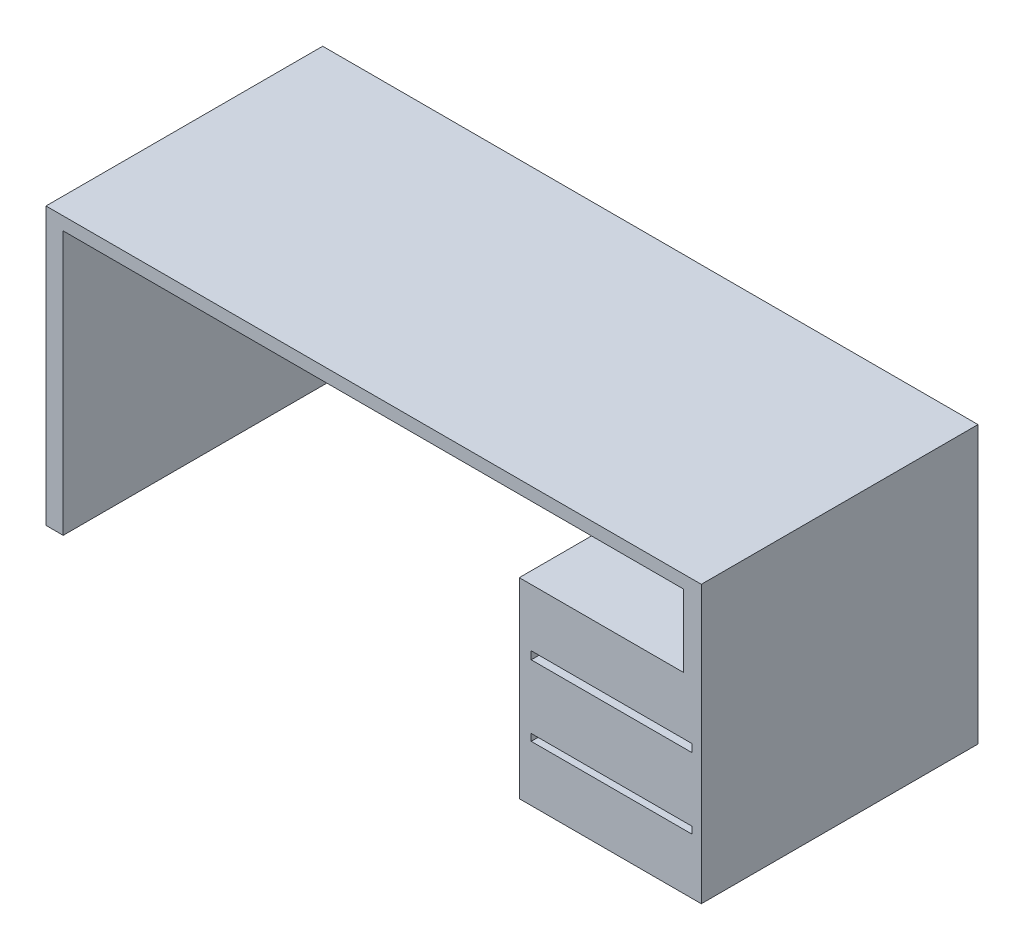
ISO-10303-21;
HEADER;
FILE_DESCRIPTION(('STEP AP214'),'2;1');
FILE_NAME('part.step','',(''),(''),'','','');
FILE_SCHEMA(('AUTOMOTIVE_DESIGN { 1 0 10303 214 1 1 1 1 }'));
ENDSEC;
DATA;
#1=APPLICATION_CONTEXT('core data for automotive mechanical design processes');
#2=APPLICATION_PROTOCOL_DEFINITION('international standard','automotive_design',2000,#1);
#3=PRODUCT_CONTEXT('',#1,'mechanical');
#4=PRODUCT('Part','Part','',(#3));
#5=PRODUCT_RELATED_PRODUCT_CATEGORY('part','',(#4));
#6=PRODUCT_DEFINITION_FORMATION('','',#4);
#7=PRODUCT_DEFINITION_CONTEXT('part definition',#1,'design');
#8=PRODUCT_DEFINITION('design','',#6,#7);
#9=PRODUCT_DEFINITION_SHAPE('','',#8);
#10=(LENGTH_UNIT() NAMED_UNIT(*) SI_UNIT(.MILLI.,.METRE.));
#11=(NAMED_UNIT(*) PLANE_ANGLE_UNIT() SI_UNIT($,.RADIAN.));
#12=(NAMED_UNIT(*) SI_UNIT($,.STERADIAN.) SOLID_ANGLE_UNIT());
#13=UNCERTAINTY_MEASURE_WITH_UNIT(LENGTH_MEASURE(1.E-05),#10,'distance_accuracy_value','');
#14=(GEOMETRIC_REPRESENTATION_CONTEXT(3) GLOBAL_UNCERTAINTY_ASSIGNED_CONTEXT((#13)) GLOBAL_UNIT_ASSIGNED_CONTEXT((#10,
#11,#12)) REPRESENTATION_CONTEXT('',''));
#15=CARTESIAN_POINT('',(0.,0.,0.));
#16=DIRECTION('',(0.,0.,1.));
#17=DIRECTION('',(1.,0.,0.));
#18=AXIS2_PLACEMENT_3D('',#15,#16,#17);
#19=CARTESIAN_POINT('',(47.2136844991558,0.,760.));
#20=DIRECTION('',(0.,1.,0.));
#21=DIRECTION('',(0.,0.,1.));
#22=AXIS2_PLACEMENT_3D('',#19,#20,#21);
#23=PLANE('',#22);
#24=DIRECTION('',(1.,0.,0.));
#25=VECTOR('',#24,1.);
#26=CARTESIAN_POINT('',(47.2136844991558,0.,0.));
#27=LINE('',#26,#25);
#28=CARTESIAN_POINT('',(0.,0.,0.));
#29=VERTEX_POINT('',#28);
#30=CARTESIAN_POINT('',(47.2136844991558,0.,0.));
#31=VERTEX_POINT('',#30);
#32=EDGE_CURVE('E198',#29,#31,#27,.T.);
#33=ORIENTED_EDGE('',*,*,#32,.T.);
#34=DIRECTION('',(0.,0.,-1.));
#35=VECTOR('',#34,1.);
#36=CARTESIAN_POINT('',(47.2136844991558,0.,760.));
#37=LINE('',#36,#35);
#38=CARTESIAN_POINT('',(47.2136844991558,0.,760.));
#39=VERTEX_POINT('',#38);
#40=EDGE_CURVE('E273',#39,#31,#37,.T.);
#41=ORIENTED_EDGE('',*,*,#40,.F.);
#42=DIRECTION('',(1.,0.,0.));
#43=VECTOR('',#42,1.);
#44=CARTESIAN_POINT('',(47.2136844991558,0.,760.));
#45=LINE('',#44,#43);
#46=CARTESIAN_POINT('',(0.,0.,760.));
#47=VERTEX_POINT('',#46);
#48=EDGE_CURVE('E205',#47,#39,#45,.T.);
#49=ORIENTED_EDGE('',*,*,#48,.F.);
#50=DIRECTION('',(0.,0.,-1.));
#51=VECTOR('',#50,1.);
#52=CARTESIAN_POINT('',(0.,0.,760.));
#53=LINE('',#52,#51);
#54=EDGE_CURVE('E227',#47,#29,#53,.T.);
#55=ORIENTED_EDGE('',*,*,#54,.T.);
#56=EDGE_LOOP('',(#33,#41,#49,#55));
#57=FACE_BOUND('',#56,.T.);
#58=ADVANCED_FACE('F33',(#57),#23,.F.);
#59=CARTESIAN_POINT('',(47.2136844991558,724.319370664102,760.));
#60=DIRECTION('',(-1.,0.,0.));
#61=DIRECTION('',(0.,0.,1.));
#62=AXIS2_PLACEMENT_3D('',#59,#60,#61);
#63=PLANE('',#62);
#64=DIRECTION('',(0.,1.,0.));
#65=VECTOR('',#64,1.);
#66=CARTESIAN_POINT('',(47.2136844991558,724.319370664102,0.));
#67=LINE('',#66,#65);
#68=CARTESIAN_POINT('',(47.2136844991558,724.319370664102,0.));
#69=VERTEX_POINT('',#68);
#70=EDGE_CURVE('E230',#31,#69,#67,.T.);
#71=ORIENTED_EDGE('',*,*,#70,.T.);
#72=DIRECTION('',(0.,0.,-1.));
#73=VECTOR('',#72,1.);
#74=CARTESIAN_POINT('',(47.2136844991558,724.319370664102,760.));
#75=LINE('',#74,#73);
#76=CARTESIAN_POINT('',(47.2136844991558,724.319370664102,760.));
#77=VERTEX_POINT('',#76);
#78=EDGE_CURVE('E270',#77,#69,#75,.T.);
#79=ORIENTED_EDGE('',*,*,#78,.F.);
#80=DIRECTION('',(0.,1.,0.));
#81=VECTOR('',#80,1.);
#82=CARTESIAN_POINT('',(47.2136844991558,724.319370664102,760.));
#83=LINE('',#82,#81);
#84=EDGE_CURVE('E208',#39,#77,#83,.T.);
#85=ORIENTED_EDGE('',*,*,#84,.F.);
#86=ORIENTED_EDGE('',*,*,#40,.T.);
#87=EDGE_LOOP('',(#71,#79,#85,#86));
#88=FACE_BOUND('',#87,.T.);
#89=ADVANCED_FACE('F310',(#88),#63,.F.);
#90=CARTESIAN_POINT('',(1750.46794536571,724.319370664102,760.));
#91=DIRECTION('',(0.,1.,0.));
#92=DIRECTION('',(-1.,0.,0.));
#93=AXIS2_PLACEMENT_3D('',#90,#91,#92);
#94=PLANE('',#93);
#95=DIRECTION('',(1.,0.,0.));
#96=VECTOR('',#95,1.);
#97=CARTESIAN_POINT('',(1750.46794536571,724.319370664102,0.));
#98=LINE('',#97,#96);
#99=CARTESIAN_POINT('',(1750.46794536571,724.319370664102,0.));
#100=VERTEX_POINT('',#99);
#101=EDGE_CURVE('E232',#69,#100,#98,.T.);
#102=ORIENTED_EDGE('',*,*,#101,.T.);
#103=DIRECTION('',(0.,0.,-1.));
#104=VECTOR('',#103,1.);
#105=CARTESIAN_POINT('',(1750.46794536571,724.319370664102,760.));
#106=LINE('',#105,#104);
#107=CARTESIAN_POINT('',(1750.46794536571,724.319370664102,760.));
#108=VERTEX_POINT('',#107);
#109=EDGE_CURVE('E267',#108,#100,#106,.T.);
#110=ORIENTED_EDGE('',*,*,#109,.F.);
#111=DIRECTION('',(1.,0.,0.));
#112=VECTOR('',#111,1.);
#113=CARTESIAN_POINT('',(1750.46794536571,724.319370664102,760.));
#114=LINE('',#113,#112);
#115=EDGE_CURVE('E211',#77,#108,#114,.T.);
#116=ORIENTED_EDGE('',*,*,#115,.F.);
#117=ORIENTED_EDGE('',*,*,#78,.T.);
#118=EDGE_LOOP('',(#102,#110,#116,#117));
#119=FACE_BOUND('',#118,.T.);
#120=ADVANCED_FACE('F315',(#119),#94,.F.);
#121=CARTESIAN_POINT('',(1750.46794536571,525.84586998317,760.));
#122=DIRECTION('',(1.,0.,0.));
#123=DIRECTION('',(0.,0.,-1.));
#124=AXIS2_PLACEMENT_3D('',#121,#122,#123);
#125=PLANE('',#124);
#126=DIRECTION('',(0.,-1.,0.));
#127=VECTOR('',#126,1.);
#128=CARTESIAN_POINT('',(1750.46794536571,525.84586998317,0.));
#129=LINE('',#128,#127);
#130=CARTESIAN_POINT('',(1750.46794536571,525.84586998317,0.));
#131=VERTEX_POINT('',#130);
#132=EDGE_CURVE('E234',#100,#131,#129,.T.);
#133=ORIENTED_EDGE('',*,*,#132,.T.);
#134=DIRECTION('',(0.,0.,-1.));
#135=VECTOR('',#134,1.);
#136=CARTESIAN_POINT('',(1750.46794536571,525.84586998317,760.));
#137=LINE('',#136,#135);
#138=CARTESIAN_POINT('',(1750.46794536571,525.84586998317,760.));
#139=VERTEX_POINT('',#138);
#140=EDGE_CURVE('E264',#139,#131,#137,.T.);
#141=ORIENTED_EDGE('',*,*,#140,.F.);
#142=DIRECTION('',(0.,-1.,0.));
#143=VECTOR('',#142,1.);
#144=CARTESIAN_POINT('',(1750.46794536571,525.84586998317,760.));
#145=LINE('',#144,#143);
#146=EDGE_CURVE('E213',#108,#139,#145,.T.);
#147=ORIENTED_EDGE('',*,*,#146,.F.);
#148=ORIENTED_EDGE('',*,*,#109,.T.);
#149=EDGE_LOOP('',(#133,#141,#147,#148));
#150=FACE_BOUND('',#149,.T.);
#151=ADVANCED_FACE('F359',(#150),#125,.F.);
#152=CARTESIAN_POINT('',(1300.,525.84586998317,760.));
#153=DIRECTION('',(0.,-1.,0.));
#154=DIRECTION('',(0.,0.,-1.));
#155=AXIS2_PLACEMENT_3D('',#152,#153,#154);
#156=PLANE('',#155);
#157=DIRECTION('',(-1.,0.,0.));
#158=VECTOR('',#157,1.);
#159=CARTESIAN_POINT('',(1300.,525.84586998317,0.));
#160=LINE('',#159,#158);
#161=CARTESIAN_POINT('',(1300.,525.84586998317,0.));
#162=VERTEX_POINT('',#161);
#163=EDGE_CURVE('E236',#131,#162,#160,.T.);
#164=ORIENTED_EDGE('',*,*,#163,.T.);
#165=DIRECTION('',(0.,0.,-1.));
#166=VECTOR('',#165,1.);
#167=CARTESIAN_POINT('',(1300.,525.84586998317,760.));
#168=LINE('',#167,#166);
#169=CARTESIAN_POINT('',(1300.,525.84586998317,760.));
#170=VERTEX_POINT('',#169);
#171=EDGE_CURVE('E261',#170,#162,#168,.T.);
#172=ORIENTED_EDGE('',*,*,#171,.F.);
#173=DIRECTION('',(-1.,0.,0.));
#174=VECTOR('',#173,1.);
#175=CARTESIAN_POINT('',(1300.,525.84586998317,760.));
#176=LINE('',#175,#174);
#177=EDGE_CURVE('E215',#139,#170,#176,.T.);
#178=ORIENTED_EDGE('',*,*,#177,.F.);
#179=ORIENTED_EDGE('',*,*,#140,.T.);
#180=EDGE_LOOP('',(#164,#172,#178,#179));
#181=FACE_BOUND('',#180,.T.);
#182=ADVANCED_FACE('F354',(#181),#156,.F.);
#183=CARTESIAN_POINT('',(1300.,0.,760.));
#184=DIRECTION('',(1.,0.,0.));
#185=DIRECTION('',(0.,0.,-1.));
#186=AXIS2_PLACEMENT_3D('',#183,#184,#185);
#187=PLANE('',#186);
#188=DIRECTION('',(0.,-1.,0.));
#189=VECTOR('',#188,1.);
#190=CARTESIAN_POINT('',(1300.,0.,0.));
#191=LINE('',#190,#189);
#192=CARTESIAN_POINT('',(1300.,0.,0.));
#193=VERTEX_POINT('',#192);
#194=EDGE_CURVE('E238',#162,#193,#191,.T.);
#195=ORIENTED_EDGE('',*,*,#194,.T.);
#196=DIRECTION('',(0.,0.,-1.));
#197=VECTOR('',#196,1.);
#198=CARTESIAN_POINT('',(1300.,0.,760.));
#199=LINE('',#198,#197);
#200=CARTESIAN_POINT('',(1300.,0.,760.));
#201=VERTEX_POINT('',#200);
#202=EDGE_CURVE('E258',#201,#193,#199,.T.);
#203=ORIENTED_EDGE('',*,*,#202,.F.);
#204=DIRECTION('',(0.,-1.,0.));
#205=VECTOR('',#204,1.);
#206=CARTESIAN_POINT('',(1300.,0.,760.));
#207=LINE('',#206,#205);
#208=EDGE_CURVE('E217',#170,#201,#207,.T.);
#209=ORIENTED_EDGE('',*,*,#208,.F.);
#210=ORIENTED_EDGE('',*,*,#171,.T.);
#211=EDGE_LOOP('',(#195,#203,#209,#210));
#212=FACE_BOUND('',#211,.T.);
#213=ADVANCED_FACE('F350',(#212),#187,.F.);
#214=CARTESIAN_POINT('',(1800.,0.,760.));
#215=DIRECTION('',(0.,1.,0.));
#216=DIRECTION('',(-1.,0.,0.));
#217=AXIS2_PLACEMENT_3D('',#214,#215,#216);
#218=PLANE('',#217);
#219=DIRECTION('',(1.,0.,0.));
#220=VECTOR('',#219,1.);
#221=CARTESIAN_POINT('',(1800.,0.,0.));
#222=LINE('',#221,#220);
#223=CARTESIAN_POINT('',(1800.,0.,0.));
#224=VERTEX_POINT('',#223);
#225=EDGE_CURVE('E240',#193,#224,#222,.T.);
#226=ORIENTED_EDGE('',*,*,#225,.T.);
#227=DIRECTION('',(0.,0.,-1.));
#228=VECTOR('',#227,1.);
#229=CARTESIAN_POINT('',(1800.,0.,760.));
#230=LINE('',#229,#228);
#231=CARTESIAN_POINT('',(1800.,0.,760.));
#232=VERTEX_POINT('',#231);
#233=EDGE_CURVE('E255',#232,#224,#230,.T.);
#234=ORIENTED_EDGE('',*,*,#233,.F.);
#235=DIRECTION('',(1.,0.,0.));
#236=VECTOR('',#235,1.);
#237=CARTESIAN_POINT('',(1800.,0.,760.));
#238=LINE('',#237,#236);
#239=EDGE_CURVE('E219',#201,#232,#238,.T.);
#240=ORIENTED_EDGE('',*,*,#239,.F.);
#241=ORIENTED_EDGE('',*,*,#202,.T.);
#242=EDGE_LOOP('',(#226,#234,#240,#241));
#243=FACE_BOUND('',#242,.T.);
#244=ADVANCED_FACE('F346',(#243),#218,.F.);
#245=CARTESIAN_POINT('',(1800.,760.,760.));
#246=DIRECTION('',(-1.,0.,0.));
#247=DIRECTION('',(0.,-1.,0.));
#248=AXIS2_PLACEMENT_3D('',#245,#246,#247);
#249=PLANE('',#248);
#250=DIRECTION('',(0.,1.,0.));
#251=VECTOR('',#250,1.);
#252=CARTESIAN_POINT('',(1800.,760.,0.));
#253=LINE('',#252,#251);
#254=CARTESIAN_POINT('',(1800.,760.,0.));
#255=VERTEX_POINT('',#254);
#256=EDGE_CURVE('E242',#224,#255,#253,.T.);
#257=ORIENTED_EDGE('',*,*,#256,.T.);
#258=DIRECTION('',(0.,0.,-1.));
#259=VECTOR('',#258,1.);
#260=CARTESIAN_POINT('',(1800.,760.,760.));
#261=LINE('',#260,#259);
#262=CARTESIAN_POINT('',(1800.,760.,760.));
#263=VERTEX_POINT('',#262);
#264=EDGE_CURVE('E252',#263,#255,#261,.T.);
#265=ORIENTED_EDGE('',*,*,#264,.F.);
#266=DIRECTION('',(0.,1.,0.));
#267=VECTOR('',#266,1.);
#268=CARTESIAN_POINT('',(1800.,760.,760.));
#269=LINE('',#268,#267);
#270=EDGE_CURVE('E221',#232,#263,#269,.T.);
#271=ORIENTED_EDGE('',*,*,#270,.F.);
#272=ORIENTED_EDGE('',*,*,#233,.T.);
#273=EDGE_LOOP('',(#257,#265,#271,#272));
#274=FACE_BOUND('',#273,.T.);
#275=ADVANCED_FACE('F341',(#274),#249,.F.);
#276=CARTESIAN_POINT('',(0.,760.,760.));
#277=DIRECTION('',(0.,-1.,0.));
#278=DIRECTION('',(0.,0.,-1.));
#279=AXIS2_PLACEMENT_3D('',#276,#277,#278);
#280=PLANE('',#279);
#281=DIRECTION('',(-1.,0.,0.));
#282=VECTOR('',#281,1.);
#283=CARTESIAN_POINT('',(0.,760.,0.));
#284=LINE('',#283,#282);
#285=CARTESIAN_POINT('',(0.,760.,0.));
#286=VERTEX_POINT('',#285);
#287=EDGE_CURVE('E244',#255,#286,#284,.T.);
#288=ORIENTED_EDGE('',*,*,#287,.T.);
#289=DIRECTION('',(0.,0.,-1.));
#290=VECTOR('',#289,1.);
#291=CARTESIAN_POINT('',(0.,760.,760.));
#292=LINE('',#291,#290);
#293=CARTESIAN_POINT('',(0.,760.,760.));
#294=VERTEX_POINT('',#293);
#295=EDGE_CURVE('E249',#294,#286,#292,.T.);
#296=ORIENTED_EDGE('',*,*,#295,.F.);
#297=DIRECTION('',(-1.,0.,0.));
#298=VECTOR('',#297,1.);
#299=CARTESIAN_POINT('',(0.,760.,760.));
#300=LINE('',#299,#298);
#301=EDGE_CURVE('E223',#263,#294,#300,.T.);
#302=ORIENTED_EDGE('',*,*,#301,.F.);
#303=ORIENTED_EDGE('',*,*,#264,.T.);
#304=EDGE_LOOP('',(#288,#296,#302,#303));
#305=FACE_BOUND('',#304,.T.);
#306=ADVANCED_FACE('F335',(#305),#280,.F.);
#307=CARTESIAN_POINT('',(0.,0.,760.));
#308=DIRECTION('',(1.,0.,0.));
#309=DIRECTION('',(0.,0.,-1.));
#310=AXIS2_PLACEMENT_3D('',#307,#308,#309);
#311=PLANE('',#310);
#312=DIRECTION('',(0.,-1.,0.));
#313=VECTOR('',#312,1.);
#314=CARTESIAN_POINT('',(0.,0.,0.));
#315=LINE('',#314,#313);
#316=EDGE_CURVE('E209',#286,#29,#315,.T.);
#317=ORIENTED_EDGE('',*,*,#316,.T.);
#318=ORIENTED_EDGE('',*,*,#54,.F.);
#319=DIRECTION('',(0.,-1.,0.));
#320=VECTOR('',#319,1.);
#321=CARTESIAN_POINT('',(0.,0.,760.));
#322=LINE('',#321,#320);
#323=EDGE_CURVE('E225',#294,#47,#322,.T.);
#324=ORIENTED_EDGE('',*,*,#323,.F.);
#325=ORIENTED_EDGE('',*,*,#295,.T.);
#326=EDGE_LOOP('',(#317,#318,#324,#325));
#327=FACE_BOUND('',#326,.T.);
#328=ADVANCED_FACE('F333',(#327),#311,.F.);
#329=CARTESIAN_POINT('',(0.,0.,760.));
#330=DIRECTION('',(0.,0.,-1.));
#331=DIRECTION('',(-1.,0.,0.));
#332=AXIS2_PLACEMENT_3D('',#329,#330,#331);
#333=PLANE('',#332);
#334=DIRECTION('',(1.,0.,0.));
#335=VECTOR('',#334,1.);
#336=CARTESIAN_POINT('',(1332.75546162445,152.803699489511,760.));
#337=LINE('',#336,#335);
#338=CARTESIAN_POINT('',(1332.75546162445,152.803699489511,760.));
#339=VERTEX_POINT('',#338);
#340=CARTESIAN_POINT('',(1774.52601864916,152.803699489511,760.));
#341=VERTEX_POINT('',#340);
#342=EDGE_CURVE('E168',#339,#341,#337,.T.);
#343=ORIENTED_EDGE('',*,*,#342,.F.);
#344=DIRECTION('',(0.,-1.,0.));
#345=VECTOR('',#344,1.);
#346=CARTESIAN_POINT('',(1332.75546162445,171.659759850322,760.));
#347=LINE('',#346,#345);
#348=CARTESIAN_POINT('',(1332.75546162445,171.659759850322,760.));
#349=VERTEX_POINT('',#348);
#350=EDGE_CURVE('E47',#349,#339,#347,.T.);
#351=ORIENTED_EDGE('',*,*,#350,.F.);
#352=DIRECTION('',(-1.,0.,0.));
#353=VECTOR('',#352,1.);
#354=CARTESIAN_POINT('',(1332.75546162445,171.659759850322,760.));
#355=LINE('',#354,#353);
#356=CARTESIAN_POINT('',(1774.52601864916,171.659759850322,760.));
#357=VERTEX_POINT('',#356);
#358=EDGE_CURVE('E175',#357,#349,#355,.T.);
#359=ORIENTED_EDGE('',*,*,#358,.F.);
#360=DIRECTION('',(0.,1.,0.));
#361=VECTOR('',#360,1.);
#362=CARTESIAN_POINT('',(1774.52601864916,171.659759850322,760.));
#363=LINE('',#362,#361);
#364=EDGE_CURVE('E159',#341,#357,#363,.T.);
#365=ORIENTED_EDGE('',*,*,#364,.F.);
#366=EDGE_LOOP('',(#343,#351,#359,#365));
#367=FACE_BOUND('',#366,.T.);
#368=DIRECTION('',(1.,0.,0.));
#369=VECTOR('',#368,1.);
#370=CARTESIAN_POINT('',(1332.75546162445,346.751748914993,760.));
#371=LINE('',#370,#369);
#372=CARTESIAN_POINT('',(1332.75546162445,346.751748914993,760.));
#373=VERTEX_POINT('',#372);
#374=CARTESIAN_POINT('',(1774.52601864916,346.751748914993,760.));
#375=VERTEX_POINT('',#374);
#376=EDGE_CURVE('E186',#373,#375,#371,.T.);
#377=ORIENTED_EDGE('',*,*,#376,.F.);
#378=DIRECTION('',(0.,-1.,0.));
#379=VECTOR('',#378,1.);
#380=CARTESIAN_POINT('',(1332.75546162445,368.301532184491,760.));
#381=LINE('',#380,#379);
#382=CARTESIAN_POINT('',(1332.75546162445,368.301532184491,760.));
#383=VERTEX_POINT('',#382);
#384=EDGE_CURVE('E182',#383,#373,#381,.T.);
#385=ORIENTED_EDGE('',*,*,#384,.F.);
#386=DIRECTION('',(-1.,0.,0.));
#387=VECTOR('',#386,1.);
#388=CARTESIAN_POINT('',(1332.75546162445,368.301532184491,760.));
#389=LINE('',#388,#387);
#390=CARTESIAN_POINT('',(1774.52601864916,368.301532184491,760.));
#391=VERTEX_POINT('',#390);
#392=EDGE_CURVE('E192',#391,#383,#389,.T.);
#393=ORIENTED_EDGE('',*,*,#392,.F.);
#394=DIRECTION('',(0.,1.,0.));
#395=VECTOR('',#394,1.);
#396=CARTESIAN_POINT('',(1774.52601864916,368.301532184491,760.));
#397=LINE('',#396,#395);
#398=EDGE_CURVE('E189',#375,#391,#397,.T.);
#399=ORIENTED_EDGE('',*,*,#398,.F.);
#400=EDGE_LOOP('',(#377,#385,#393,#399));
#401=FACE_BOUND('',#400,.T.);
#402=ORIENTED_EDGE('',*,*,#48,.T.);
#403=ORIENTED_EDGE('',*,*,#84,.T.);
#404=ORIENTED_EDGE('',*,*,#115,.T.);
#405=ORIENTED_EDGE('',*,*,#146,.T.);
#406=ORIENTED_EDGE('',*,*,#177,.T.);
#407=ORIENTED_EDGE('',*,*,#208,.T.);
#408=ORIENTED_EDGE('',*,*,#239,.T.);
#409=ORIENTED_EDGE('',*,*,#270,.T.);
#410=ORIENTED_EDGE('',*,*,#301,.T.);
#411=ORIENTED_EDGE('',*,*,#323,.T.);
#412=EDGE_LOOP('',(#402,#403,#404,#405,#406,#407,#408,#409,#410,#411));
#413=FACE_BOUND('',#412,.T.);
#414=ADVANCED_FACE('F172',(#367,#401,#413),#333,.F.);
#415=CARTESIAN_POINT('',(0.,0.,0.));
#416=DIRECTION('',(0.,0.,-1.));
#417=DIRECTION('',(-1.,0.,0.));
#418=AXIS2_PLACEMENT_3D('',#415,#416,#417);
#419=PLANE('',#418);
#420=DIRECTION('',(0.,1.,0.));
#421=VECTOR('',#420,1.);
#422=CARTESIAN_POINT('',(1332.75546162445,0.,0.));
#423=LINE('',#422,#421);
#424=CARTESIAN_POINT('',(1332.75546162445,152.803699489511,0.));
#425=VERTEX_POINT('',#424);
#426=CARTESIAN_POINT('',(1332.75546162445,171.659759850322,0.));
#427=VERTEX_POINT('',#426);
#428=EDGE_CURVE('E11',#425,#427,#423,.T.);
#429=ORIENTED_EDGE('',*,*,#428,.F.);
#430=DIRECTION('',(-1.,0.,0.));
#431=VECTOR('',#430,1.);
#432=CARTESIAN_POINT('',(0.,152.803699489511,0.));
#433=LINE('',#432,#431);
#434=CARTESIAN_POINT('',(1774.52601864916,152.803699489511,0.));
#435=VERTEX_POINT('',#434);
#436=EDGE_CURVE('E285',#435,#425,#433,.T.);
#437=ORIENTED_EDGE('',*,*,#436,.F.);
#438=DIRECTION('',(0.,-1.,0.));
#439=VECTOR('',#438,1.);
#440=CARTESIAN_POINT('',(1774.52601864916,0.,0.));
#441=LINE('',#440,#439);
#442=CARTESIAN_POINT('',(1774.52601864916,171.659759850322,0.));
#443=VERTEX_POINT('',#442);
#444=EDGE_CURVE('E162',#443,#435,#441,.T.);
#445=ORIENTED_EDGE('',*,*,#444,.F.);
#446=DIRECTION('',(1.,0.,0.));
#447=VECTOR('',#446,1.);
#448=CARTESIAN_POINT('',(0.,171.659759850322,0.));
#449=LINE('',#448,#447);
#450=EDGE_CURVE('E40',#427,#443,#449,.T.);
#451=ORIENTED_EDGE('',*,*,#450,.F.);
#452=EDGE_LOOP('',(#429,#437,#445,#451));
#453=FACE_BOUND('',#452,.T.);
#454=DIRECTION('',(0.,1.,0.));
#455=VECTOR('',#454,1.);
#456=CARTESIAN_POINT('',(1332.75546162445,0.,0.));
#457=LINE('',#456,#455);
#458=CARTESIAN_POINT('',(1332.75546162445,346.751748914993,0.));
#459=VERTEX_POINT('',#458);
#460=CARTESIAN_POINT('',(1332.75546162445,368.301532184491,0.));
#461=VERTEX_POINT('',#460);
#462=EDGE_CURVE('E283',#459,#461,#457,.T.);
#463=ORIENTED_EDGE('',*,*,#462,.F.);
#464=DIRECTION('',(-1.,0.,0.));
#465=VECTOR('',#464,1.);
#466=CARTESIAN_POINT('',(0.,346.751748914993,0.));
#467=LINE('',#466,#465);
#468=CARTESIAN_POINT('',(1774.52601864916,346.751748914993,0.));
#469=VERTEX_POINT('',#468);
#470=EDGE_CURVE('E276',#469,#459,#467,.T.);
#471=ORIENTED_EDGE('',*,*,#470,.F.);
#472=DIRECTION('',(0.,-1.,0.));
#473=VECTOR('',#472,1.);
#474=CARTESIAN_POINT('',(1774.52601864916,0.,0.));
#475=LINE('',#474,#473);
#476=CARTESIAN_POINT('',(1774.52601864916,368.301532184491,0.));
#477=VERTEX_POINT('',#476);
#478=EDGE_CURVE('E278',#477,#469,#475,.T.);
#479=ORIENTED_EDGE('',*,*,#478,.F.);
#480=DIRECTION('',(1.,0.,0.));
#481=VECTOR('',#480,1.);
#482=CARTESIAN_POINT('',(0.,368.301532184491,0.));
#483=LINE('',#482,#481);
#484=EDGE_CURVE('E281',#461,#477,#483,.T.);
#485=ORIENTED_EDGE('',*,*,#484,.F.);
#486=EDGE_LOOP('',(#463,#471,#479,#485));
#487=FACE_BOUND('',#486,.T.);
#488=ORIENTED_EDGE('',*,*,#32,.F.);
#489=ORIENTED_EDGE('',*,*,#316,.F.);
#490=ORIENTED_EDGE('',*,*,#287,.F.);
#491=ORIENTED_EDGE('',*,*,#256,.F.);
#492=ORIENTED_EDGE('',*,*,#225,.F.);
#493=ORIENTED_EDGE('',*,*,#194,.F.);
#494=ORIENTED_EDGE('',*,*,#163,.F.);
#495=ORIENTED_EDGE('',*,*,#132,.F.);
#496=ORIENTED_EDGE('',*,*,#101,.F.);
#497=ORIENTED_EDGE('',*,*,#70,.F.);
#498=EDGE_LOOP('',(#488,#489,#490,#491,#492,#493,#494,#495,#496,#497));
#499=FACE_BOUND('',#498,.T.);
#500=ADVANCED_FACE('F293',(#453,#487,#499),#419,.T.);
#501=CARTESIAN_POINT('',(1332.75546162445,368.301532184491,-139.));
#502=DIRECTION('',(-1.,0.,0.));
#503=DIRECTION('',(0.,0.,1.));
#504=AXIS2_PLACEMENT_3D('',#501,#502,#503);
#505=PLANE('',#504);
#506=ORIENTED_EDGE('',*,*,#462,.T.);
#507=DIRECTION('',(0.,0.,1.));
#508=VECTOR('',#507,1.);
#509=CARTESIAN_POINT('',(1332.75546162445,368.301532184491,-139.));
#510=LINE('',#509,#508);
#511=EDGE_CURVE('E196',#461,#383,#510,.T.);
#512=ORIENTED_EDGE('',*,*,#511,.T.);
#513=ORIENTED_EDGE('',*,*,#384,.T.);
#514=DIRECTION('',(0.,0.,1.));
#515=VECTOR('',#514,1.);
#516=CARTESIAN_POINT('',(1332.75546162445,346.751748914993,-139.));
#517=LINE('',#516,#515);
#518=EDGE_CURVE('E195',#459,#373,#517,.T.);
#519=ORIENTED_EDGE('',*,*,#518,.F.);
#520=EDGE_LOOP('',(#506,#512,#513,#519));
#521=FACE_BOUND('',#520,.T.);
#522=ADVANCED_FACE('F383',(#521),#505,.F.);
#523=CARTESIAN_POINT('',(1332.75546162445,368.301532184491,-139.));
#524=DIRECTION('',(0.,1.,0.));
#525=DIRECTION('',(0.,0.,1.));
#526=AXIS2_PLACEMENT_3D('',#523,#524,#525);
#527=PLANE('',#526);
#528=ORIENTED_EDGE('',*,*,#484,.T.);
#529=DIRECTION('',(0.,0.,1.));
#530=VECTOR('',#529,1.);
#531=CARTESIAN_POINT('',(1774.52601864916,368.301532184491,-139.));
#532=LINE('',#531,#530);
#533=EDGE_CURVE('E199',#477,#391,#532,.T.);
#534=ORIENTED_EDGE('',*,*,#533,.T.);
#535=ORIENTED_EDGE('',*,*,#392,.T.);
#536=ORIENTED_EDGE('',*,*,#511,.F.);
#537=EDGE_LOOP('',(#528,#534,#535,#536));
#538=FACE_BOUND('',#537,.T.);
#539=ADVANCED_FACE('F387',(#538),#527,.F.);
#540=CARTESIAN_POINT('',(1774.52601864916,368.301532184491,-139.));
#541=DIRECTION('',(1.,0.,0.));
#542=DIRECTION('',(0.,0.,-1.));
#543=AXIS2_PLACEMENT_3D('',#540,#541,#542);
#544=PLANE('',#543);
#545=ORIENTED_EDGE('',*,*,#478,.T.);
#546=DIRECTION('',(0.,0.,1.));
#547=VECTOR('',#546,1.);
#548=CARTESIAN_POINT('',(1774.52601864916,346.751748914993,-139.));
#549=LINE('',#548,#547);
#550=EDGE_CURVE('E201',#469,#375,#549,.T.);
#551=ORIENTED_EDGE('',*,*,#550,.T.);
#552=ORIENTED_EDGE('',*,*,#398,.T.);
#553=ORIENTED_EDGE('',*,*,#533,.F.);
#554=EDGE_LOOP('',(#545,#551,#552,#553));
#555=FACE_BOUND('',#554,.T.);
#556=ADVANCED_FACE('F304',(#555),#544,.F.);
#557=CARTESIAN_POINT('',(1332.75546162445,346.751748914993,-139.));
#558=DIRECTION('',(0.,-1.,0.));
#559=DIRECTION('',(0.,0.,-1.));
#560=AXIS2_PLACEMENT_3D('',#557,#558,#559);
#561=PLANE('',#560);
#562=ORIENTED_EDGE('',*,*,#470,.T.);
#563=ORIENTED_EDGE('',*,*,#518,.T.);
#564=ORIENTED_EDGE('',*,*,#376,.T.);
#565=ORIENTED_EDGE('',*,*,#550,.F.);
#566=EDGE_LOOP('',(#562,#563,#564,#565));
#567=FACE_BOUND('',#566,.T.);
#568=ADVANCED_FACE('F297',(#567),#561,.F.);
#569=CARTESIAN_POINT('',(1332.75546162445,171.659759850322,-139.));
#570=DIRECTION('',(-1.,0.,0.));
#571=DIRECTION('',(0.,0.,1.));
#572=AXIS2_PLACEMENT_3D('',#569,#570,#571);
#573=PLANE('',#572);
#574=ORIENTED_EDGE('',*,*,#428,.T.);
#575=DIRECTION('',(0.,0.,1.));
#576=VECTOR('',#575,1.);
#577=CARTESIAN_POINT('',(1332.75546162445,171.659759850322,-139.));
#578=LINE('',#577,#576);
#579=EDGE_CURVE('E180',#427,#349,#578,.T.);
#580=ORIENTED_EDGE('',*,*,#579,.T.);
#581=ORIENTED_EDGE('',*,*,#350,.T.);
#582=DIRECTION('',(0.,0.,1.));
#583=VECTOR('',#582,1.);
#584=CARTESIAN_POINT('',(1332.75546162445,152.803699489511,-139.));
#585=LINE('',#584,#583);
#586=EDGE_CURVE('E165',#425,#339,#585,.T.);
#587=ORIENTED_EDGE('',*,*,#586,.F.);
#588=EDGE_LOOP('',(#574,#580,#581,#587));
#589=FACE_BOUND('',#588,.T.);
#590=ADVANCED_FACE('F295',(#589),#573,.F.);
#591=CARTESIAN_POINT('',(1332.75546162445,171.659759850322,-139.));
#592=DIRECTION('',(0.,1.,0.));
#593=DIRECTION('',(0.,0.,1.));
#594=AXIS2_PLACEMENT_3D('',#591,#592,#593);
#595=PLANE('',#594);
#596=ORIENTED_EDGE('',*,*,#450,.T.);
#597=DIRECTION('',(0.,0.,1.));
#598=VECTOR('',#597,1.);
#599=CARTESIAN_POINT('',(1774.52601864916,171.659759850322,-139.));
#600=LINE('',#599,#598);
#601=EDGE_CURVE('E164',#443,#357,#600,.T.);
#602=ORIENTED_EDGE('',*,*,#601,.T.);
#603=ORIENTED_EDGE('',*,*,#358,.T.);
#604=ORIENTED_EDGE('',*,*,#579,.F.);
#605=EDGE_LOOP('',(#596,#602,#603,#604));
#606=FACE_BOUND('',#605,.T.);
#607=ADVANCED_FACE('F290',(#606),#595,.F.);
#608=CARTESIAN_POINT('',(1774.52601864916,171.659759850322,-139.));
#609=DIRECTION('',(1.,0.,0.));
#610=DIRECTION('',(0.,0.,-1.));
#611=AXIS2_PLACEMENT_3D('',#608,#609,#610);
#612=PLANE('',#611);
#613=ORIENTED_EDGE('',*,*,#444,.T.);
#614=DIRECTION('',(0.,0.,1.));
#615=VECTOR('',#614,1.);
#616=CARTESIAN_POINT('',(1774.52601864916,152.803699489511,-139.));
#617=LINE('',#616,#615);
#618=EDGE_CURVE('E55',#435,#341,#617,.T.);
#619=ORIENTED_EDGE('',*,*,#618,.T.);
#620=ORIENTED_EDGE('',*,*,#364,.T.);
#621=ORIENTED_EDGE('',*,*,#601,.F.);
#622=EDGE_LOOP('',(#613,#619,#620,#621));
#623=FACE_BOUND('',#622,.T.);
#624=ADVANCED_FACE('F156',(#623),#612,.F.);
#625=CARTESIAN_POINT('',(1332.75546162445,152.803699489511,-139.));
#626=DIRECTION('',(0.,-1.,0.));
#627=DIRECTION('',(0.,0.,-1.));
#628=AXIS2_PLACEMENT_3D('',#625,#626,#627);
#629=PLANE('',#628);
#630=ORIENTED_EDGE('',*,*,#436,.T.);
#631=ORIENTED_EDGE('',*,*,#586,.T.);
#632=ORIENTED_EDGE('',*,*,#342,.T.);
#633=ORIENTED_EDGE('',*,*,#618,.F.);
#634=EDGE_LOOP('',(#630,#631,#632,#633));
#635=FACE_BOUND('',#634,.T.);
#636=ADVANCED_FACE('F169',(#635),#629,.F.);
#637=CLOSED_SHELL('',(#58,#89,#120,#151,#182,#213,#244,#275,#306,#328,#414,#500,#522,#539,#556,
#568,#590,#607,#624,#636));
#638=MANIFOLD_SOLID_BREP('B2',#637);
#639=ADVANCED_BREP_SHAPE_REPRESENTATION('',(#18,#638),#14);
#640=SHAPE_DEFINITION_REPRESENTATION(#9,#639);
ENDSEC;
END-ISO-10303-21;
